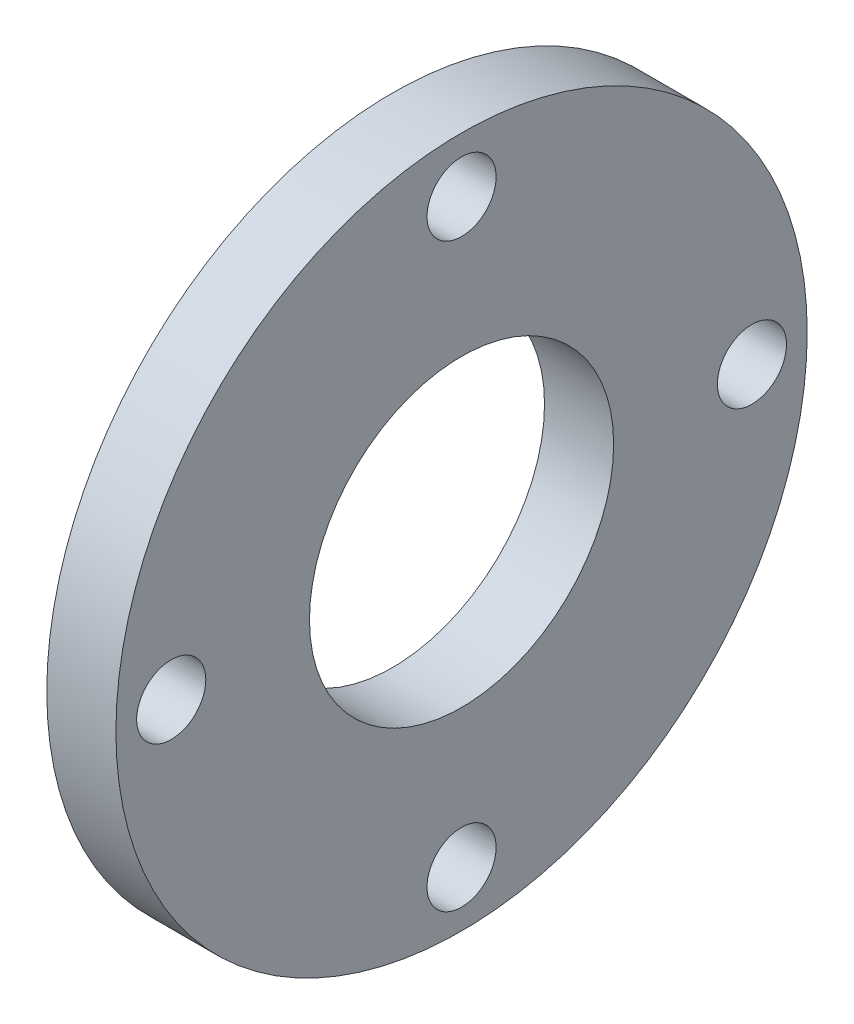
ISO-10303-21;
HEADER;
FILE_DESCRIPTION(('STEP AP214'),'2;1');
FILE_NAME('part.step','',(''),(''),'','','');
FILE_SCHEMA(('AUTOMOTIVE_DESIGN { 1 0 10303 214 1 1 1 1 }'));
ENDSEC;
DATA;
#1=APPLICATION_CONTEXT('core data for automotive mechanical design processes');
#2=APPLICATION_PROTOCOL_DEFINITION('international standard','automotive_design',2000,#1);
#3=PRODUCT_CONTEXT('',#1,'mechanical');
#4=PRODUCT('Part','Part','',(#3));
#5=PRODUCT_RELATED_PRODUCT_CATEGORY('part','',(#4));
#6=PRODUCT_DEFINITION_FORMATION('','',#4);
#7=PRODUCT_DEFINITION_CONTEXT('part definition',#1,'design');
#8=PRODUCT_DEFINITION('design','',#6,#7);
#9=PRODUCT_DEFINITION_SHAPE('','',#8);
#10=(LENGTH_UNIT() NAMED_UNIT(*) SI_UNIT(.MILLI.,.METRE.));
#11=(NAMED_UNIT(*) PLANE_ANGLE_UNIT() SI_UNIT($,.RADIAN.));
#12=(NAMED_UNIT(*) SI_UNIT($,.STERADIAN.) SOLID_ANGLE_UNIT());
#13=UNCERTAINTY_MEASURE_WITH_UNIT(LENGTH_MEASURE(1.E-05),#10,'distance_accuracy_value','');
#14=(GEOMETRIC_REPRESENTATION_CONTEXT(3) GLOBAL_UNCERTAINTY_ASSIGNED_CONTEXT((#13)) GLOBAL_UNIT_ASSIGNED_CONTEXT((#10,
#11,#12)) REPRESENTATION_CONTEXT('',''));
#15=CARTESIAN_POINT('',(0.,0.,0.));
#16=DIRECTION('',(0.,0.,1.));
#17=DIRECTION('',(1.,0.,0.));
#18=AXIS2_PLACEMENT_3D('',#15,#16,#17);
#19=CARTESIAN_POINT('',(5.,0.,0.));
#20=DIRECTION('',(1.,0.,0.));
#21=DIRECTION('',(0.,0.,-1.));
#22=AXIS2_PLACEMENT_3D('',#19,#20,#21);
#23=PLANE('',#22);
#24=CARTESIAN_POINT('',(5.,4.24856065297083E-13,-21.0000000000004));
#25=DIRECTION('',(1.,0.,0.));
#26=DIRECTION('',(0.,0.,-1.));
#27=AXIS2_PLACEMENT_3D('',#24,#25,#26);
#28=CIRCLE('',#27,2.5);
#29=CARTESIAN_POINT('',(5.,4.24856065297083E-13,-23.5000000000004));
#30=VERTEX_POINT('',#29);
#31=EDGE_CURVE('E57',#30,#30,#28,.T.);
#32=ORIENTED_EDGE('',*,*,#31,.F.);
#33=EDGE_LOOP('',(#32));
#34=FACE_BOUND('',#33,.T.);
#35=CARTESIAN_POINT('',(5.,-21.,-8.49712130594167E-13));
#36=DIRECTION('',(1.,0.,0.));
#37=DIRECTION('',(0.,0.,-1.));
#38=AXIS2_PLACEMENT_3D('',#35,#36,#37);
#39=CIRCLE('',#38,2.5);
#40=CARTESIAN_POINT('',(5.,-21.,-2.50000000000085));
#41=VERTEX_POINT('',#40);
#42=EDGE_CURVE('E102',#41,#41,#39,.T.);
#43=ORIENTED_EDGE('',*,*,#42,.F.);
#44=EDGE_LOOP('',(#43));
#45=FACE_BOUND('',#44,.T.);
#46=CARTESIAN_POINT('',(5.,-4.27427823575293E-13,20.9999999999996));
#47=DIRECTION('',(1.,0.,0.));
#48=DIRECTION('',(0.,0.,-1.));
#49=AXIS2_PLACEMENT_3D('',#46,#47,#48);
#50=CIRCLE('',#49,2.5);
#51=CARTESIAN_POINT('',(5.,-4.27427823575293E-13,18.4999999999996));
#52=VERTEX_POINT('',#51);
#53=EDGE_CURVE('E69',#52,#52,#50,.T.);
#54=ORIENTED_EDGE('',*,*,#53,.F.);
#55=EDGE_LOOP('',(#54));
#56=FACE_BOUND('',#55,.T.);
#57=CARTESIAN_POINT('',(5.,21.,0.));
#58=DIRECTION('',(1.,0.,0.));
#59=DIRECTION('',(0.,0.,-1.));
#60=AXIS2_PLACEMENT_3D('',#57,#58,#59);
#61=CIRCLE('',#60,2.5);
#62=CARTESIAN_POINT('',(5.,21.,-2.5));
#63=VERTEX_POINT('',#62);
#64=EDGE_CURVE('E53',#63,#63,#61,.T.);
#65=ORIENTED_EDGE('',*,*,#64,.F.);
#66=EDGE_LOOP('',(#65));
#67=FACE_BOUND('',#66,.T.);
#68=CARTESIAN_POINT('',(5.,0.,0.));
#69=DIRECTION('',(1.,0.,0.));
#70=DIRECTION('',(0.,0.,-1.));
#71=AXIS2_PLACEMENT_3D('',#68,#69,#70);
#72=CIRCLE('',#71,25.);
#73=CARTESIAN_POINT('',(5.,0.,-25.));
#74=VERTEX_POINT('',#73);
#75=EDGE_CURVE('E10',#74,#74,#72,.T.);
#76=ORIENTED_EDGE('',*,*,#75,.T.);
#77=EDGE_LOOP('',(#76));
#78=FACE_BOUND('',#77,.T.);
#79=CARTESIAN_POINT('',(5.,0.,0.));
#80=DIRECTION('',(1.,0.,0.));
#81=DIRECTION('',(0.,0.,-1.));
#82=AXIS2_PLACEMENT_3D('',#79,#80,#81);
#83=CIRCLE('',#82,11.);
#84=CARTESIAN_POINT('',(5.,0.,-11.));
#85=VERTEX_POINT('',#84);
#86=EDGE_CURVE('E44',#85,#85,#83,.T.);
#87=ORIENTED_EDGE('',*,*,#86,.F.);
#88=EDGE_LOOP('',(#87));
#89=FACE_BOUND('',#88,.T.);
#90=ADVANCED_FACE('F31',(#34,#45,#56,#67,#78,#89),#23,.T.);
#91=CARTESIAN_POINT('',(0.,0.,0.));
#92=DIRECTION('',(1.,0.,0.));
#93=DIRECTION('',(0.,0.,-1.));
#94=AXIS2_PLACEMENT_3D('',#91,#92,#93);
#95=PLANE('',#94);
#96=CARTESIAN_POINT('',(0.,4.24856065297083E-13,-21.0000000000004));
#97=DIRECTION('',(1.,0.,0.));
#98=DIRECTION('',(0.,0.,-1.));
#99=AXIS2_PLACEMENT_3D('',#96,#97,#98);
#100=CIRCLE('',#99,2.5);
#101=CARTESIAN_POINT('',(0.,4.24856065297083E-13,-23.5000000000004));
#102=VERTEX_POINT('',#101);
#103=EDGE_CURVE('E35',#102,#102,#100,.T.);
#104=ORIENTED_EDGE('',*,*,#103,.T.);
#105=EDGE_LOOP('',(#104));
#106=FACE_BOUND('',#105,.T.);
#107=CARTESIAN_POINT('',(0.,-21.,-8.49712130594167E-13));
#108=DIRECTION('',(1.,0.,0.));
#109=DIRECTION('',(0.,0.,-1.));
#110=AXIS2_PLACEMENT_3D('',#107,#108,#109);
#111=CIRCLE('',#110,2.5);
#112=CARTESIAN_POINT('',(0.,-21.,-2.50000000000085));
#113=VERTEX_POINT('',#112);
#114=EDGE_CURVE('E56',#113,#113,#111,.T.);
#115=ORIENTED_EDGE('',*,*,#114,.T.);
#116=EDGE_LOOP('',(#115));
#117=FACE_BOUND('',#116,.T.);
#118=CARTESIAN_POINT('',(0.,-4.27427823575293E-13,20.9999999999996));
#119=DIRECTION('',(1.,0.,0.));
#120=DIRECTION('',(0.,0.,-1.));
#121=AXIS2_PLACEMENT_3D('',#118,#119,#120);
#122=CIRCLE('',#121,2.5);
#123=CARTESIAN_POINT('',(0.,-4.27427823575293E-13,18.4999999999996));
#124=VERTEX_POINT('',#123);
#125=EDGE_CURVE('E54',#124,#124,#122,.T.);
#126=ORIENTED_EDGE('',*,*,#125,.T.);
#127=EDGE_LOOP('',(#126));
#128=FACE_BOUND('',#127,.T.);
#129=CARTESIAN_POINT('',(0.,21.,0.));
#130=DIRECTION('',(1.,0.,0.));
#131=DIRECTION('',(0.,0.,-1.));
#132=AXIS2_PLACEMENT_3D('',#129,#130,#131);
#133=CIRCLE('',#132,2.5);
#134=CARTESIAN_POINT('',(0.,21.,-2.5));
#135=VERTEX_POINT('',#134);
#136=EDGE_CURVE('E50',#135,#135,#133,.T.);
#137=ORIENTED_EDGE('',*,*,#136,.T.);
#138=EDGE_LOOP('',(#137));
#139=FACE_BOUND('',#138,.T.);
#140=CARTESIAN_POINT('',(0.,0.,0.));
#141=DIRECTION('',(1.,0.,0.));
#142=DIRECTION('',(0.,0.,-1.));
#143=AXIS2_PLACEMENT_3D('',#140,#141,#142);
#144=CIRCLE('',#143,25.);
#145=CARTESIAN_POINT('',(0.,0.,-25.));
#146=VERTEX_POINT('',#145);
#147=EDGE_CURVE('E39',#146,#146,#144,.T.);
#148=ORIENTED_EDGE('',*,*,#147,.F.);
#149=EDGE_LOOP('',(#148));
#150=FACE_BOUND('',#149,.T.);
#151=CARTESIAN_POINT('',(0.,0.,0.));
#152=DIRECTION('',(1.,0.,0.));
#153=DIRECTION('',(0.,0.,-1.));
#154=AXIS2_PLACEMENT_3D('',#151,#152,#153);
#155=CIRCLE('',#154,11.);
#156=CARTESIAN_POINT('',(0.,0.,-11.));
#157=VERTEX_POINT('',#156);
#158=EDGE_CURVE('E47',#157,#157,#155,.T.);
#159=ORIENTED_EDGE('',*,*,#158,.T.);
#160=EDGE_LOOP('',(#159));
#161=FACE_BOUND('',#160,.T.);
#162=ADVANCED_FACE('F77',(#106,#117,#128,#139,#150,#161),#95,.F.);
#163=CARTESIAN_POINT('',(5.,0.,0.));
#164=DIRECTION('',(-1.,0.,0.));
#165=DIRECTION('',(0.,0.,1.));
#166=AXIS2_PLACEMENT_3D('',#163,#164,#165);
#167=CYLINDRICAL_SURFACE('',#166,25.);
#168=ORIENTED_EDGE('',*,*,#75,.F.);
#169=EDGE_LOOP('',(#168));
#170=FACE_BOUND('',#169,.T.);
#171=ORIENTED_EDGE('',*,*,#147,.T.);
#172=EDGE_LOOP('',(#171));
#173=FACE_BOUND('',#172,.T.);
#174=ADVANCED_FACE('F33',(#170,#173),#167,.T.);
#175=CARTESIAN_POINT('',(5.,0.,0.));
#176=DIRECTION('',(-1.,0.,0.));
#177=DIRECTION('',(0.,0.,1.));
#178=AXIS2_PLACEMENT_3D('',#175,#176,#177);
#179=CYLINDRICAL_SURFACE('',#178,11.);
#180=ORIENTED_EDGE('',*,*,#86,.T.);
#181=EDGE_LOOP('',(#180));
#182=FACE_BOUND('',#181,.T.);
#183=ORIENTED_EDGE('',*,*,#158,.F.);
#184=EDGE_LOOP('',(#183));
#185=FACE_BOUND('',#184,.T.);
#186=ADVANCED_FACE('F79',(#182,#185),#179,.F.);
#187=CARTESIAN_POINT('',(-5.,21.,0.));
#188=DIRECTION('',(1.,0.,0.));
#189=DIRECTION('',(0.,0.,-1.));
#190=AXIS2_PLACEMENT_3D('',#187,#188,#189);
#191=CYLINDRICAL_SURFACE('',#190,2.5);
#192=ORIENTED_EDGE('',*,*,#64,.T.);
#193=EDGE_LOOP('',(#192));
#194=FACE_BOUND('',#193,.T.);
#195=ORIENTED_EDGE('',*,*,#136,.F.);
#196=EDGE_LOOP('',(#195));
#197=FACE_BOUND('',#196,.T.);
#198=ADVANCED_FACE('F81',(#194,#197),#191,.F.);
#199=CARTESIAN_POINT('',(-5.,-4.27427823575293E-13,20.9999999999996));
#200=DIRECTION('',(1.,0.,0.));
#201=DIRECTION('',(0.,0.,-1.));
#202=AXIS2_PLACEMENT_3D('',#199,#200,#201);
#203=CYLINDRICAL_SURFACE('',#202,2.5);
#204=ORIENTED_EDGE('',*,*,#53,.T.);
#205=EDGE_LOOP('',(#204));
#206=FACE_BOUND('',#205,.T.);
#207=ORIENTED_EDGE('',*,*,#125,.F.);
#208=EDGE_LOOP('',(#207));
#209=FACE_BOUND('',#208,.T.);
#210=ADVANCED_FACE('F87',(#206,#209),#203,.F.);
#211=CARTESIAN_POINT('',(-5.,-21.,-8.49712130594167E-13));
#212=DIRECTION('',(1.,0.,0.));
#213=DIRECTION('',(0.,0.,-1.));
#214=AXIS2_PLACEMENT_3D('',#211,#212,#213);
#215=CYLINDRICAL_SURFACE('',#214,2.5);
#216=ORIENTED_EDGE('',*,*,#42,.T.);
#217=EDGE_LOOP('',(#216));
#218=FACE_BOUND('',#217,.T.);
#219=ORIENTED_EDGE('',*,*,#114,.F.);
#220=EDGE_LOOP('',(#219));
#221=FACE_BOUND('',#220,.T.);
#222=ADVANCED_FACE('F114',(#218,#221),#215,.F.);
#223=CARTESIAN_POINT('',(-5.,4.24856065297083E-13,-21.0000000000004));
#224=DIRECTION('',(1.,0.,0.));
#225=DIRECTION('',(0.,0.,-1.));
#226=AXIS2_PLACEMENT_3D('',#223,#224,#225);
#227=CYLINDRICAL_SURFACE('',#226,2.5);
#228=ORIENTED_EDGE('',*,*,#31,.T.);
#229=EDGE_LOOP('',(#228));
#230=FACE_BOUND('',#229,.T.);
#231=ORIENTED_EDGE('',*,*,#103,.F.);
#232=EDGE_LOOP('',(#231));
#233=FACE_BOUND('',#232,.T.);
#234=ADVANCED_FACE('F111',(#230,#233),#227,.F.);
#235=CLOSED_SHELL('',(#90,#162,#174,#186,#198,#210,#222,#234));
#236=MANIFOLD_SOLID_BREP('B2',#235);
#237=ADVANCED_BREP_SHAPE_REPRESENTATION('',(#18,#236),#14);
#238=SHAPE_DEFINITION_REPRESENTATION(#9,#237);
ENDSEC;
END-ISO-10303-21;
